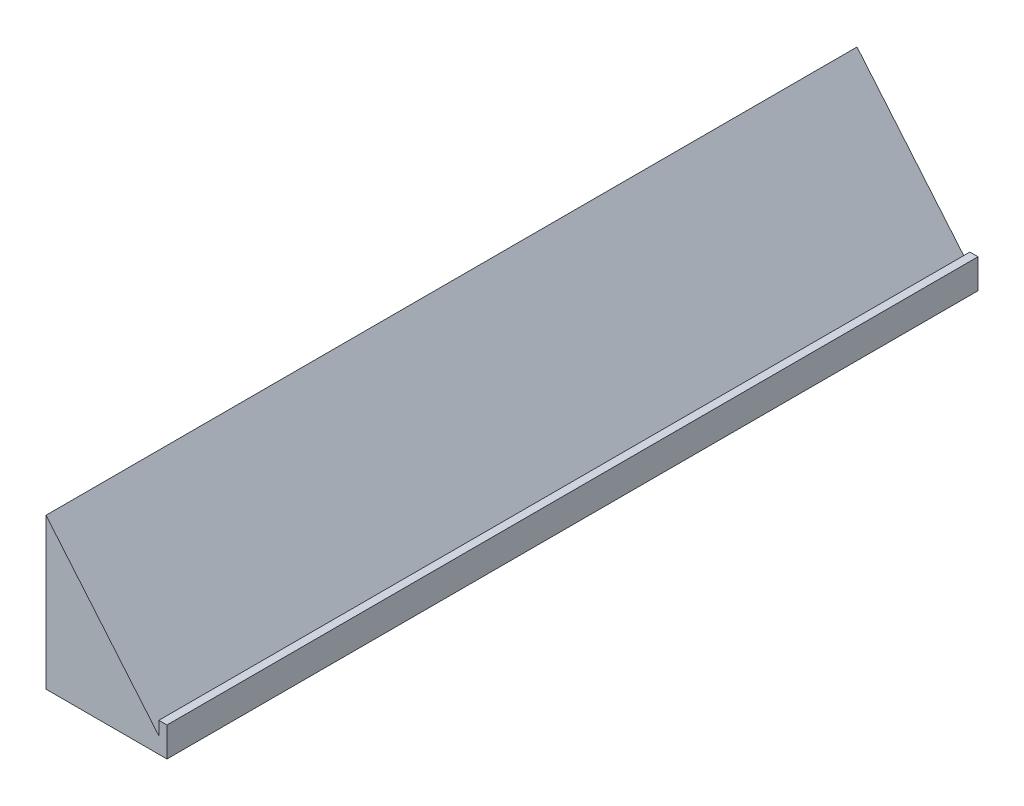
ISO-10303-21;
HEADER;
FILE_DESCRIPTION(('STEP AP214'),'2;1');
FILE_NAME('part.step','',(''),(''),'','','');
FILE_SCHEMA(('AUTOMOTIVE_DESIGN { 1 0 10303 214 1 1 1 1 }'));
ENDSEC;
DATA;
#1=APPLICATION_CONTEXT('core data for automotive mechanical design processes');
#2=APPLICATION_PROTOCOL_DEFINITION('international standard','automotive_design',2000,#1);
#3=PRODUCT_CONTEXT('',#1,'mechanical');
#4=PRODUCT('Part','Part','',(#3));
#5=PRODUCT_RELATED_PRODUCT_CATEGORY('part','',(#4));
#6=PRODUCT_DEFINITION_FORMATION('','',#4);
#7=PRODUCT_DEFINITION_CONTEXT('part definition',#1,'design');
#8=PRODUCT_DEFINITION('design','',#6,#7);
#9=PRODUCT_DEFINITION_SHAPE('','',#8);
#10=(LENGTH_UNIT() NAMED_UNIT(*) SI_UNIT(.MILLI.,.METRE.));
#11=(NAMED_UNIT(*) PLANE_ANGLE_UNIT() SI_UNIT($,.RADIAN.));
#12=(NAMED_UNIT(*) SI_UNIT($,.STERADIAN.) SOLID_ANGLE_UNIT());
#13=UNCERTAINTY_MEASURE_WITH_UNIT(LENGTH_MEASURE(1.E-05),#10,'distance_accuracy_value','');
#14=(GEOMETRIC_REPRESENTATION_CONTEXT(3) GLOBAL_UNCERTAINTY_ASSIGNED_CONTEXT((#13)) GLOBAL_UNIT_ASSIGNED_CONTEXT((#10,
#11,#12)) REPRESENTATION_CONTEXT('',''));
#15=CARTESIAN_POINT('',(0.,0.,0.));
#16=DIRECTION('',(0.,0.,1.));
#17=DIRECTION('',(1.,0.,0.));
#18=AXIS2_PLACEMENT_3D('',#15,#16,#17);
#19=CARTESIAN_POINT('',(44.7471309589339,-5.72815533980582,300.));
#20=DIRECTION('',(0.,1.,0.));
#21=DIRECTION('',(0.,0.,1.));
#22=AXIS2_PLACEMENT_3D('',#19,#20,#21);
#23=PLANE('',#22);
#24=DIRECTION('',(1.,0.,0.));
#25=VECTOR('',#24,1.);
#26=CARTESIAN_POINT('',(44.7471309589339,-5.72815533980582,0.));
#27=LINE('',#26,#25);
#28=CARTESIAN_POINT('',(0.,-5.72815533980582,0.));
#29=VERTEX_POINT('',#28);
#30=CARTESIAN_POINT('',(44.7471309589339,-5.72815533980582,0.));
#31=VERTEX_POINT('',#30);
#32=EDGE_CURVE('E132',#29,#31,#27,.T.);
#33=ORIENTED_EDGE('',*,*,#32,.T.);
#34=DIRECTION('',(0.,0.,-1.));
#35=VECTOR('',#34,1.);
#36=CARTESIAN_POINT('',(44.7471309589339,-5.72815533980582,300.));
#37=LINE('',#36,#35);
#38=CARTESIAN_POINT('',(44.7471309589339,-5.72815533980582,300.));
#39=VERTEX_POINT('',#38);
#40=EDGE_CURVE('E48',#39,#31,#37,.T.);
#41=ORIENTED_EDGE('',*,*,#40,.F.);
#42=DIRECTION('',(1.,0.,0.));
#43=VECTOR('',#42,1.);
#44=CARTESIAN_POINT('',(44.7471309589339,-5.72815533980582,300.));
#45=LINE('',#44,#43);
#46=CARTESIAN_POINT('',(0.,-5.72815533980582,300.));
#47=VERTEX_POINT('',#46);
#48=EDGE_CURVE('E94',#47,#39,#45,.T.);
#49=ORIENTED_EDGE('',*,*,#48,.F.);
#50=DIRECTION('',(0.,0.,-1.));
#51=VECTOR('',#50,1.);
#52=CARTESIAN_POINT('',(0.,-5.72815533980582,300.));
#53=LINE('',#52,#51);
#54=EDGE_CURVE('E11',#47,#29,#53,.T.);
#55=ORIENTED_EDGE('',*,*,#54,.T.);
#56=EDGE_LOOP('',(#33,#41,#49,#55));
#57=FACE_BOUND('',#56,.T.);
#58=ADVANCED_FACE('F39',(#57),#23,.F.);
#59=CARTESIAN_POINT('',(44.7471309589339,5.17854822771996,300.));
#60=DIRECTION('',(-1.,0.,0.));
#61=DIRECTION('',(0.,0.,1.));
#62=AXIS2_PLACEMENT_3D('',#59,#60,#61);
#63=PLANE('',#62);
#64=DIRECTION('',(0.,1.,0.));
#65=VECTOR('',#64,1.);
#66=CARTESIAN_POINT('',(44.7471309589339,5.17854822771996,0.));
#67=LINE('',#66,#65);
#68=CARTESIAN_POINT('',(44.7471309589339,5.17854822771996,0.));
#69=VERTEX_POINT('',#68);
#70=EDGE_CURVE('E135',#31,#69,#67,.T.);
#71=ORIENTED_EDGE('',*,*,#70,.T.);
#72=DIRECTION('',(0.,0.,-1.));
#73=VECTOR('',#72,1.);
#74=CARTESIAN_POINT('',(44.7471309589339,5.17854822771996,300.));
#75=LINE('',#74,#73);
#76=CARTESIAN_POINT('',(44.7471309589339,5.17854822771996,300.));
#77=VERTEX_POINT('',#76);
#78=EDGE_CURVE('E119',#77,#69,#75,.T.);
#79=ORIENTED_EDGE('',*,*,#78,.F.);
#80=DIRECTION('',(0.,1.,0.));
#81=VECTOR('',#80,1.);
#82=CARTESIAN_POINT('',(44.7471309589339,5.17854822771996,300.));
#83=LINE('',#82,#81);
#84=EDGE_CURVE('E108',#39,#77,#83,.T.);
#85=ORIENTED_EDGE('',*,*,#84,.F.);
#86=ORIENTED_EDGE('',*,*,#40,.T.);
#87=EDGE_LOOP('',(#71,#79,#85,#86));
#88=FACE_BOUND('',#87,.T.);
#89=ADVANCED_FACE('F156',(#88),#63,.F.);
#90=CARTESIAN_POINT('',(41.7471309589339,5.17854822771996,300.));
#91=DIRECTION('',(0.,-1.,0.));
#92=DIRECTION('',(0.,0.,-1.));
#93=AXIS2_PLACEMENT_3D('',#90,#91,#92);
#94=PLANE('',#93);
#95=DIRECTION('',(-1.,0.,0.));
#96=VECTOR('',#95,1.);
#97=CARTESIAN_POINT('',(41.7471309589339,5.17854822771996,0.));
#98=LINE('',#97,#96);
#99=CARTESIAN_POINT('',(41.7471309589339,5.17854822771996,0.));
#100=VERTEX_POINT('',#99);
#101=EDGE_CURVE('E117',#69,#100,#98,.T.);
#102=ORIENTED_EDGE('',*,*,#101,.T.);
#103=DIRECTION('',(0.,0.,-1.));
#104=VECTOR('',#103,1.);
#105=CARTESIAN_POINT('',(41.7471309589339,5.17854822771996,300.));
#106=LINE('',#105,#104);
#107=CARTESIAN_POINT('',(41.7471309589339,5.17854822771996,300.));
#108=VERTEX_POINT('',#107);
#109=EDGE_CURVE('E114',#108,#100,#106,.T.);
#110=ORIENTED_EDGE('',*,*,#109,.F.);
#111=DIRECTION('',(-1.,0.,0.));
#112=VECTOR('',#111,1.);
#113=CARTESIAN_POINT('',(41.7471309589339,5.17854822771996,300.));
#114=LINE('',#113,#112);
#115=EDGE_CURVE('E102',#77,#108,#114,.T.);
#116=ORIENTED_EDGE('',*,*,#115,.F.);
#117=ORIENTED_EDGE('',*,*,#78,.T.);
#118=EDGE_LOOP('',(#102,#110,#116,#117));
#119=FACE_BOUND('',#118,.T.);
#120=ADVANCED_FACE('F115',(#119),#94,.F.);
#121=CARTESIAN_POINT('',(41.7471309589339,0.178548227719962,300.));
#122=DIRECTION('',(1.,0.,0.));
#123=DIRECTION('',(0.,0.,-1.));
#124=AXIS2_PLACEMENT_3D('',#121,#122,#123);
#125=PLANE('',#124);
#126=DIRECTION('',(0.,-1.,0.));
#127=VECTOR('',#126,1.);
#128=CARTESIAN_POINT('',(41.7471309589339,0.178548227719962,0.));
#129=LINE('',#128,#127);
#130=CARTESIAN_POINT('',(41.7471309589339,0.178548227719962,0.));
#131=VERTEX_POINT('',#130);
#132=EDGE_CURVE('E80',#100,#131,#129,.T.);
#133=ORIENTED_EDGE('',*,*,#132,.T.);
#134=DIRECTION('',(0.,0.,-1.));
#135=VECTOR('',#134,1.);
#136=CARTESIAN_POINT('',(41.7471309589339,0.178548227719962,300.));
#137=LINE('',#136,#135);
#138=CARTESIAN_POINT('',(41.7471309589339,0.178548227719962,300.));
#139=VERTEX_POINT('',#138);
#140=EDGE_CURVE('E120',#139,#131,#137,.T.);
#141=ORIENTED_EDGE('',*,*,#140,.F.);
#142=DIRECTION('',(0.,-1.,0.));
#143=VECTOR('',#142,1.);
#144=CARTESIAN_POINT('',(41.7471309589339,0.178548227719962,300.));
#145=LINE('',#144,#143);
#146=EDGE_CURVE('E106',#108,#139,#145,.T.);
#147=ORIENTED_EDGE('',*,*,#146,.F.);
#148=ORIENTED_EDGE('',*,*,#109,.T.);
#149=EDGE_LOOP('',(#133,#141,#147,#148));
#150=FACE_BOUND('',#149,.T.);
#151=ADVANCED_FACE('F122',(#150),#125,.F.);
#152=CARTESIAN_POINT('',(0.,50.,300.));
#153=DIRECTION('',(-0.766483873419693,-0.642263553214367,0.));
#154=DIRECTION('',(0.642263553214367,-0.766483873419693,0.));
#155=AXIS2_PLACEMENT_3D('',#152,#153,#154);
#156=PLANE('',#155);
#157=DIRECTION('',(-0.642263553214367,0.766483873419693,0.));
#158=VECTOR('',#157,1.);
#159=CARTESIAN_POINT('',(0.,50.,0.));
#160=LINE('',#159,#158);
#161=CARTESIAN_POINT('',(0.,50.,0.));
#162=VERTEX_POINT('',#161);
#163=EDGE_CURVE('E87',#131,#162,#160,.T.);
#164=ORIENTED_EDGE('',*,*,#163,.T.);
#165=DIRECTION('',(0.,0.,-1.));
#166=VECTOR('',#165,1.);
#167=CARTESIAN_POINT('',(0.,50.,300.));
#168=LINE('',#167,#166);
#169=CARTESIAN_POINT('',(0.,50.,300.));
#170=VERTEX_POINT('',#169);
#171=EDGE_CURVE('E128',#170,#162,#168,.T.);
#172=ORIENTED_EDGE('',*,*,#171,.F.);
#173=DIRECTION('',(-0.642263553214367,0.766483873419693,0.));
#174=VECTOR('',#173,1.);
#175=CARTESIAN_POINT('',(0.,50.,300.));
#176=LINE('',#175,#174);
#177=EDGE_CURVE('E125',#139,#170,#176,.T.);
#178=ORIENTED_EDGE('',*,*,#177,.F.);
#179=ORIENTED_EDGE('',*,*,#140,.T.);
#180=EDGE_LOOP('',(#164,#172,#178,#179));
#181=FACE_BOUND('',#180,.T.);
#182=ADVANCED_FACE('F162',(#181),#156,.F.);
#183=CARTESIAN_POINT('',(0.,0.,300.));
#184=DIRECTION('',(1.,0.,0.));
#185=DIRECTION('',(0.,0.,-1.));
#186=AXIS2_PLACEMENT_3D('',#183,#184,#185);
#187=PLANE('',#186);
#188=DIRECTION('',(0.,-1.,0.));
#189=VECTOR('',#188,1.);
#190=CARTESIAN_POINT('',(0.,0.,0.));
#191=LINE('',#190,#189);
#192=EDGE_CURVE('E144',#162,#29,#191,.T.);
#193=ORIENTED_EDGE('',*,*,#192,.T.);
#194=ORIENTED_EDGE('',*,*,#54,.F.);
#195=DIRECTION('',(0.,-1.,0.));
#196=VECTOR('',#195,1.);
#197=CARTESIAN_POINT('',(0.,-5.72815533980582,300.));
#198=LINE('',#197,#196);
#199=EDGE_CURVE('E56',#170,#47,#198,.T.);
#200=ORIENTED_EDGE('',*,*,#199,.F.);
#201=ORIENTED_EDGE('',*,*,#171,.T.);
#202=EDGE_LOOP('',(#193,#194,#200,#201));
#203=FACE_BOUND('',#202,.T.);
#204=ADVANCED_FACE('F161',(#203),#187,.F.);
#205=CARTESIAN_POINT('',(0.,0.,300.));
#206=DIRECTION('',(0.,0.,-1.));
#207=DIRECTION('',(-1.,0.,0.));
#208=AXIS2_PLACEMENT_3D('',#205,#206,#207);
#209=PLANE('',#208);
#210=ORIENTED_EDGE('',*,*,#199,.T.);
#211=ORIENTED_EDGE('',*,*,#48,.T.);
#212=ORIENTED_EDGE('',*,*,#84,.T.);
#213=ORIENTED_EDGE('',*,*,#115,.T.);
#214=ORIENTED_EDGE('',*,*,#146,.T.);
#215=ORIENTED_EDGE('',*,*,#177,.T.);
#216=EDGE_LOOP('',(#210,#211,#212,#213,#214,#215));
#217=FACE_BOUND('',#216,.T.);
#218=ADVANCED_FACE('F104',(#217),#209,.F.);
#219=CARTESIAN_POINT('',(0.,0.,0.));
#220=DIRECTION('',(0.,0.,-1.));
#221=DIRECTION('',(-1.,0.,0.));
#222=AXIS2_PLACEMENT_3D('',#219,#220,#221);
#223=PLANE('',#222);
#224=ORIENTED_EDGE('',*,*,#32,.F.);
#225=ORIENTED_EDGE('',*,*,#192,.F.);
#226=ORIENTED_EDGE('',*,*,#163,.F.);
#227=ORIENTED_EDGE('',*,*,#132,.F.);
#228=ORIENTED_EDGE('',*,*,#101,.F.);
#229=ORIENTED_EDGE('',*,*,#70,.F.);
#230=EDGE_LOOP('',(#224,#225,#226,#227,#228,#229));
#231=FACE_BOUND('',#230,.T.);
#232=ADVANCED_FACE('F159',(#231),#223,.T.);
#233=CLOSED_SHELL('',(#58,#89,#120,#151,#182,#204,#218,#232));
#234=MANIFOLD_SOLID_BREP('B2',#233);
#235=ADVANCED_BREP_SHAPE_REPRESENTATION('',(#18,#234),#14);
#236=SHAPE_DEFINITION_REPRESENTATION(#9,#235);
ENDSEC;
END-ISO-10303-21;
